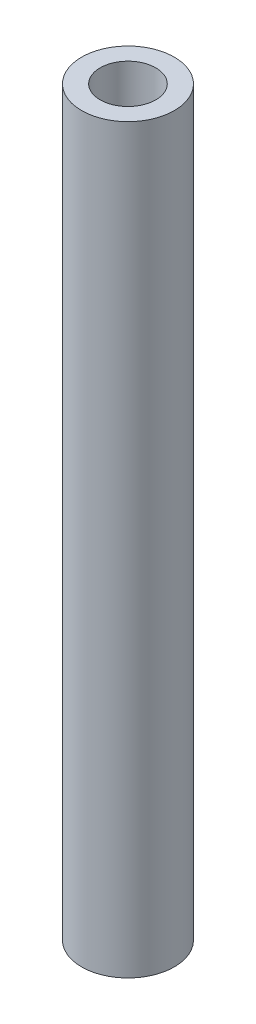
ISO-10303-21;
HEADER;
FILE_DESCRIPTION(('STEP AP214'),'2;1');
FILE_NAME('part.step','',(''),(''),'','','');
FILE_SCHEMA(('AUTOMOTIVE_DESIGN { 1 0 10303 214 1 1 1 1 }'));
ENDSEC;
DATA;
#1=APPLICATION_CONTEXT('core data for automotive mechanical design processes');
#2=APPLICATION_PROTOCOL_DEFINITION('international standard','automotive_design',2000,#1);
#3=PRODUCT_CONTEXT('',#1,'mechanical');
#4=PRODUCT('Part','Part','',(#3));
#5=PRODUCT_RELATED_PRODUCT_CATEGORY('part','',(#4));
#6=PRODUCT_DEFINITION_FORMATION('','',#4);
#7=PRODUCT_DEFINITION_CONTEXT('part definition',#1,'design');
#8=PRODUCT_DEFINITION('design','',#6,#7);
#9=PRODUCT_DEFINITION_SHAPE('','',#8);
#10=(LENGTH_UNIT() NAMED_UNIT(*) SI_UNIT(.MILLI.,.METRE.));
#11=(NAMED_UNIT(*) PLANE_ANGLE_UNIT() SI_UNIT($,.RADIAN.));
#12=(NAMED_UNIT(*) SI_UNIT($,.STERADIAN.) SOLID_ANGLE_UNIT());
#13=UNCERTAINTY_MEASURE_WITH_UNIT(LENGTH_MEASURE(1.E-05),#10,'distance_accuracy_value','');
#14=(GEOMETRIC_REPRESENTATION_CONTEXT(3) GLOBAL_UNCERTAINTY_ASSIGNED_CONTEXT((#13)) GLOBAL_UNIT_ASSIGNED_CONTEXT((#10,
#11,#12)) REPRESENTATION_CONTEXT('',''));
#15=CARTESIAN_POINT('',(0.,0.,0.));
#16=DIRECTION('',(0.,0.,1.));
#17=DIRECTION('',(1.,0.,0.));
#18=AXIS2_PLACEMENT_3D('',#15,#16,#17);
#19=CARTESIAN_POINT('',(0.,40.,0.));
#20=DIRECTION('',(0.,1.,0.));
#21=DIRECTION('',(0.,0.,1.));
#22=AXIS2_PLACEMENT_3D('',#19,#20,#21);
#23=PLANE('',#22);
#24=CARTESIAN_POINT('',(0.,40.,0.));
#25=DIRECTION('',(0.,1.,0.));
#26=DIRECTION('',(0.,0.,1.));
#27=AXIS2_PLACEMENT_3D('',#24,#25,#26);
#28=CIRCLE('',#27,2.5);
#29=CARTESIAN_POINT('',(0.,40.,2.5));
#30=VERTEX_POINT('',#29);
#31=EDGE_CURVE('E10',#30,#30,#28,.T.);
#32=ORIENTED_EDGE('',*,*,#31,.T.);
#33=EDGE_LOOP('',(#32));
#34=FACE_BOUND('',#33,.T.);
#35=CARTESIAN_POINT('',(0.,40.,0.));
#36=DIRECTION('',(0.,1.,0.));
#37=DIRECTION('',(0.,0.,1.));
#38=AXIS2_PLACEMENT_3D('',#35,#36,#37);
#39=CIRCLE('',#38,1.5);
#40=CARTESIAN_POINT('',(0.,40.,1.5));
#41=VERTEX_POINT('',#40);
#42=EDGE_CURVE('E41',#41,#41,#39,.T.);
#43=ORIENTED_EDGE('',*,*,#42,.F.);
#44=EDGE_LOOP('',(#43));
#45=FACE_BOUND('',#44,.T.);
#46=ADVANCED_FACE('F30',(#34,#45),#23,.T.);
#47=CARTESIAN_POINT('',(0.,0.,0.));
#48=DIRECTION('',(0.,1.,0.));
#49=DIRECTION('',(0.,0.,1.));
#50=AXIS2_PLACEMENT_3D('',#47,#48,#49);
#51=PLANE('',#50);
#52=CARTESIAN_POINT('',(0.,0.,0.));
#53=DIRECTION('',(0.,1.,0.));
#54=DIRECTION('',(0.,0.,1.));
#55=AXIS2_PLACEMENT_3D('',#52,#53,#54);
#56=CIRCLE('',#55,2.5);
#57=CARTESIAN_POINT('',(0.,0.,2.5));
#58=VERTEX_POINT('',#57);
#59=EDGE_CURVE('E34',#58,#58,#56,.T.);
#60=ORIENTED_EDGE('',*,*,#59,.F.);
#61=EDGE_LOOP('',(#60));
#62=FACE_BOUND('',#61,.T.);
#63=CARTESIAN_POINT('',(0.,0.,0.));
#64=DIRECTION('',(0.,1.,0.));
#65=DIRECTION('',(0.,0.,1.));
#66=AXIS2_PLACEMENT_3D('',#63,#64,#65);
#67=CIRCLE('',#66,1.5);
#68=CARTESIAN_POINT('',(0.,0.,1.5));
#69=VERTEX_POINT('',#68);
#70=EDGE_CURVE('E43',#69,#69,#67,.T.);
#71=ORIENTED_EDGE('',*,*,#70,.T.);
#72=EDGE_LOOP('',(#71));
#73=FACE_BOUND('',#72,.T.);
#74=ADVANCED_FACE('F53',(#62,#73),#51,.F.);
#75=CARTESIAN_POINT('',(0.,40.,0.));
#76=DIRECTION('',(0.,-1.,0.));
#77=DIRECTION('',(0.,0.,-1.));
#78=AXIS2_PLACEMENT_3D('',#75,#76,#77);
#79=CYLINDRICAL_SURFACE('',#78,2.5);
#80=ORIENTED_EDGE('',*,*,#31,.F.);
#81=EDGE_LOOP('',(#80));
#82=FACE_BOUND('',#81,.T.);
#83=ORIENTED_EDGE('',*,*,#59,.T.);
#84=EDGE_LOOP('',(#83));
#85=FACE_BOUND('',#84,.T.);
#86=ADVANCED_FACE('F32',(#82,#85),#79,.T.);
#87=CARTESIAN_POINT('',(0.,40.,0.));
#88=DIRECTION('',(0.,-1.,0.));
#89=DIRECTION('',(0.,0.,-1.));
#90=AXIS2_PLACEMENT_3D('',#87,#88,#89);
#91=CYLINDRICAL_SURFACE('',#90,1.5);
#92=ORIENTED_EDGE('',*,*,#42,.T.);
#93=EDGE_LOOP('',(#92));
#94=FACE_BOUND('',#93,.T.);
#95=ORIENTED_EDGE('',*,*,#70,.F.);
#96=EDGE_LOOP('',(#95));
#97=FACE_BOUND('',#96,.T.);
#98=ADVANCED_FACE('F49',(#94,#97),#91,.F.);
#99=CLOSED_SHELL('',(#46,#74,#86,#98));
#100=MANIFOLD_SOLID_BREP('B2',#99);
#101=ADVANCED_BREP_SHAPE_REPRESENTATION('',(#18,#100),#14);
#102=SHAPE_DEFINITION_REPRESENTATION(#9,#101);
ENDSEC;
END-ISO-10303-21;
